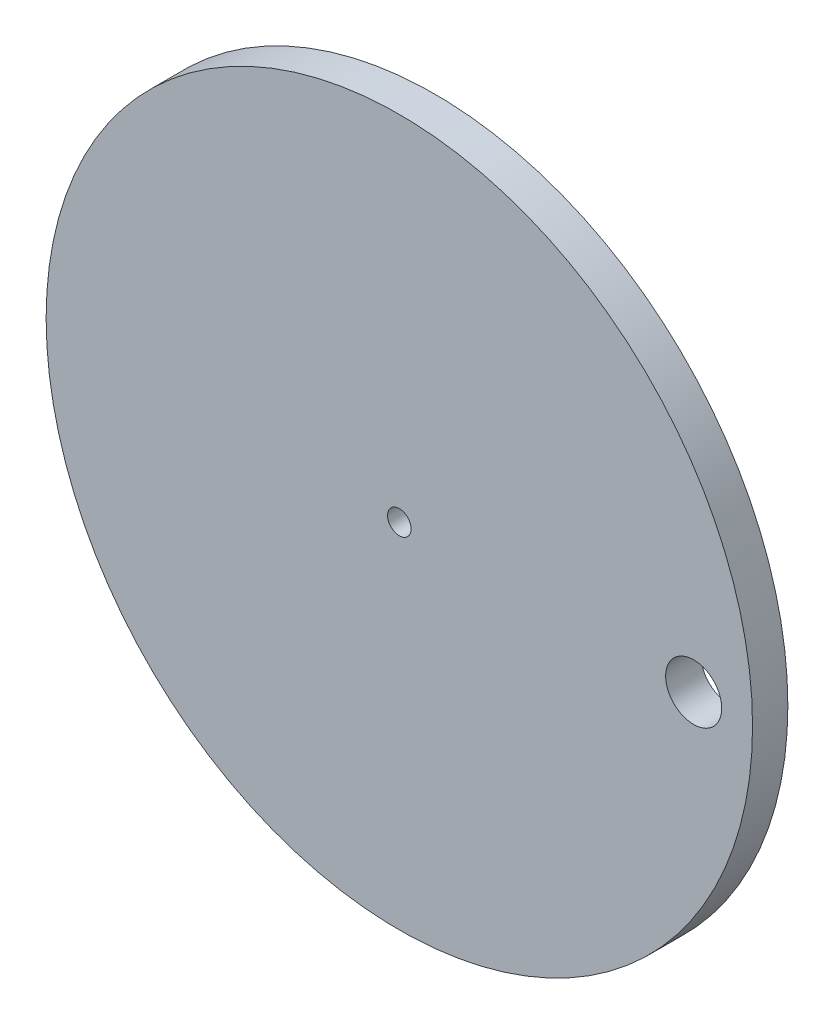
ISO-10303-21;
HEADER;
FILE_DESCRIPTION(('STEP AP214'),'2;1');
FILE_NAME('part.step','',(''),(''),'','','');
FILE_SCHEMA(('AUTOMOTIVE_DESIGN { 1 0 10303 214 1 1 1 1 }'));
ENDSEC;
DATA;
#1=APPLICATION_CONTEXT('core data for automotive mechanical design processes');
#2=APPLICATION_PROTOCOL_DEFINITION('international standard','automotive_design',2000,#1);
#3=PRODUCT_CONTEXT('',#1,'mechanical');
#4=PRODUCT('Part','Part','',(#3));
#5=PRODUCT_RELATED_PRODUCT_CATEGORY('part','',(#4));
#6=PRODUCT_DEFINITION_FORMATION('','',#4);
#7=PRODUCT_DEFINITION_CONTEXT('part definition',#1,'design');
#8=PRODUCT_DEFINITION('design','',#6,#7);
#9=PRODUCT_DEFINITION_SHAPE('','',#8);
#10=(LENGTH_UNIT() NAMED_UNIT(*) SI_UNIT(.MILLI.,.METRE.));
#11=(NAMED_UNIT(*) PLANE_ANGLE_UNIT() SI_UNIT($,.RADIAN.));
#12=(NAMED_UNIT(*) SI_UNIT($,.STERADIAN.) SOLID_ANGLE_UNIT());
#13=UNCERTAINTY_MEASURE_WITH_UNIT(LENGTH_MEASURE(1.E-05),#10,'distance_accuracy_value','');
#14=(GEOMETRIC_REPRESENTATION_CONTEXT(3) GLOBAL_UNCERTAINTY_ASSIGNED_CONTEXT((#13)) GLOBAL_UNIT_ASSIGNED_CONTEXT((#10,
#11,#12)) REPRESENTATION_CONTEXT('',''));
#15=CARTESIAN_POINT('',(0.,0.,0.));
#16=DIRECTION('',(0.,0.,1.));
#17=DIRECTION('',(1.,0.,0.));
#18=AXIS2_PLACEMENT_3D('',#15,#16,#17);
#19=CARTESIAN_POINT('',(0.,0.,3.));
#20=DIRECTION('',(0.,0.,1.));
#21=DIRECTION('',(1.,0.,0.));
#22=AXIS2_PLACEMENT_3D('',#19,#20,#21);
#23=PLANE('',#22);
#24=CARTESIAN_POINT('',(0.,0.,3.));
#25=DIRECTION('',(0.,0.,1.));
#26=DIRECTION('',(1.,0.,0.));
#27=AXIS2_PLACEMENT_3D('',#24,#25,#26);
#28=CIRCLE('',#27,1.);
#29=CARTESIAN_POINT('',(1.,0.,3.));
#30=VERTEX_POINT('',#29);
#31=EDGE_CURVE('E43',#30,#30,#28,.T.);
#32=ORIENTED_EDGE('',*,*,#31,.F.);
#33=EDGE_LOOP('',(#32));
#34=FACE_BOUND('',#33,.T.);
#35=CARTESIAN_POINT('',(0.,0.,3.));
#36=DIRECTION('',(0.,0.,1.));
#37=DIRECTION('',(1.,0.,0.));
#38=AXIS2_PLACEMENT_3D('',#35,#36,#37);
#39=CIRCLE('',#38,30.);
#40=CARTESIAN_POINT('',(30.,0.,3.));
#41=VERTEX_POINT('',#40);
#42=EDGE_CURVE('E10',#41,#41,#39,.T.);
#43=ORIENTED_EDGE('',*,*,#42,.T.);
#44=EDGE_LOOP('',(#43));
#45=FACE_BOUND('',#44,.T.);
#46=CARTESIAN_POINT('',(25.,0.,3.));
#47=DIRECTION('',(0.,0.,1.));
#48=DIRECTION('',(1.,0.,0.));
#49=AXIS2_PLACEMENT_3D('',#46,#47,#48);
#50=CIRCLE('',#49,2.38125);
#51=CARTESIAN_POINT('',(27.38125,0.,3.));
#52=VERTEX_POINT('',#51);
#53=EDGE_CURVE('E48',#52,#52,#50,.T.);
#54=ORIENTED_EDGE('',*,*,#53,.F.);
#55=EDGE_LOOP('',(#54));
#56=FACE_BOUND('',#55,.T.);
#57=ADVANCED_FACE('F32',(#34,#45,#56),#23,.T.);
#58=CARTESIAN_POINT('',(0.,0.,0.));
#59=DIRECTION('',(0.,0.,1.));
#60=DIRECTION('',(1.,0.,0.));
#61=AXIS2_PLACEMENT_3D('',#58,#59,#60);
#62=PLANE('',#61);
#63=CARTESIAN_POINT('',(0.,0.,0.));
#64=DIRECTION('',(0.,0.,1.));
#65=DIRECTION('',(1.,0.,0.));
#66=AXIS2_PLACEMENT_3D('',#63,#64,#65);
#67=CIRCLE('',#66,30.);
#68=CARTESIAN_POINT('',(30.,0.,0.));
#69=VERTEX_POINT('',#68);
#70=EDGE_CURVE('E36',#69,#69,#67,.T.);
#71=ORIENTED_EDGE('',*,*,#70,.F.);
#72=EDGE_LOOP('',(#71));
#73=FACE_BOUND('',#72,.T.);
#74=CARTESIAN_POINT('',(0.,0.,0.));
#75=DIRECTION('',(0.,0.,1.));
#76=DIRECTION('',(1.,0.,0.));
#77=AXIS2_PLACEMENT_3D('',#74,#75,#76);
#78=CIRCLE('',#77,1.);
#79=CARTESIAN_POINT('',(1.,0.,0.));
#80=VERTEX_POINT('',#79);
#81=EDGE_CURVE('E45',#80,#80,#78,.T.);
#82=ORIENTED_EDGE('',*,*,#81,.T.);
#83=EDGE_LOOP('',(#82));
#84=FACE_BOUND('',#83,.T.);
#85=CARTESIAN_POINT('',(25.,0.,0.));
#86=DIRECTION('',(0.,0.,1.));
#87=DIRECTION('',(1.,0.,0.));
#88=AXIS2_PLACEMENT_3D('',#85,#86,#87);
#89=CIRCLE('',#88,2.38125);
#90=CARTESIAN_POINT('',(27.38125,0.,0.));
#91=VERTEX_POINT('',#90);
#92=EDGE_CURVE('E51',#91,#91,#89,.T.);
#93=ORIENTED_EDGE('',*,*,#92,.T.);
#94=EDGE_LOOP('',(#93));
#95=FACE_BOUND('',#94,.T.);
#96=ADVANCED_FACE('F61',(#73,#84,#95),#62,.F.);
#97=CARTESIAN_POINT('',(0.,0.,3.));
#98=DIRECTION('',(0.,0.,-1.));
#99=DIRECTION('',(-1.,0.,0.));
#100=AXIS2_PLACEMENT_3D('',#97,#98,#99);
#101=CYLINDRICAL_SURFACE('',#100,30.);
#102=ORIENTED_EDGE('',*,*,#42,.F.);
#103=EDGE_LOOP('',(#102));
#104=FACE_BOUND('',#103,.T.);
#105=ORIENTED_EDGE('',*,*,#70,.T.);
#106=EDGE_LOOP('',(#105));
#107=FACE_BOUND('',#106,.T.);
#108=ADVANCED_FACE('F34',(#104,#107),#101,.T.);
#109=CARTESIAN_POINT('',(0.,0.,3.));
#110=DIRECTION('',(0.,0.,-1.));
#111=DIRECTION('',(-1.,0.,0.));
#112=AXIS2_PLACEMENT_3D('',#109,#110,#111);
#113=CYLINDRICAL_SURFACE('',#112,1.);
#114=ORIENTED_EDGE('',*,*,#31,.T.);
#115=EDGE_LOOP('',(#114));
#116=FACE_BOUND('',#115,.T.);
#117=ORIENTED_EDGE('',*,*,#81,.F.);
#118=EDGE_LOOP('',(#117));
#119=FACE_BOUND('',#118,.T.);
#120=ADVANCED_FACE('F70',(#116,#119),#113,.F.);
#121=CARTESIAN_POINT('',(25.,0.,3.));
#122=DIRECTION('',(0.,0.,-1.));
#123=DIRECTION('',(-1.,0.,0.));
#124=AXIS2_PLACEMENT_3D('',#121,#122,#123);
#125=CYLINDRICAL_SURFACE('',#124,2.38125);
#126=ORIENTED_EDGE('',*,*,#53,.T.);
#127=EDGE_LOOP('',(#126));
#128=FACE_BOUND('',#127,.T.);
#129=ORIENTED_EDGE('',*,*,#92,.F.);
#130=EDGE_LOOP('',(#129));
#131=FACE_BOUND('',#130,.T.);
#132=ADVANCED_FACE('F57',(#128,#131),#125,.F.);
#133=CLOSED_SHELL('',(#57,#96,#108,#120,#132));
#134=MANIFOLD_SOLID_BREP('B2',#133);
#135=ADVANCED_BREP_SHAPE_REPRESENTATION('',(#18,#134),#14);
#136=SHAPE_DEFINITION_REPRESENTATION(#9,#135);
ENDSEC;
END-ISO-10303-21;
